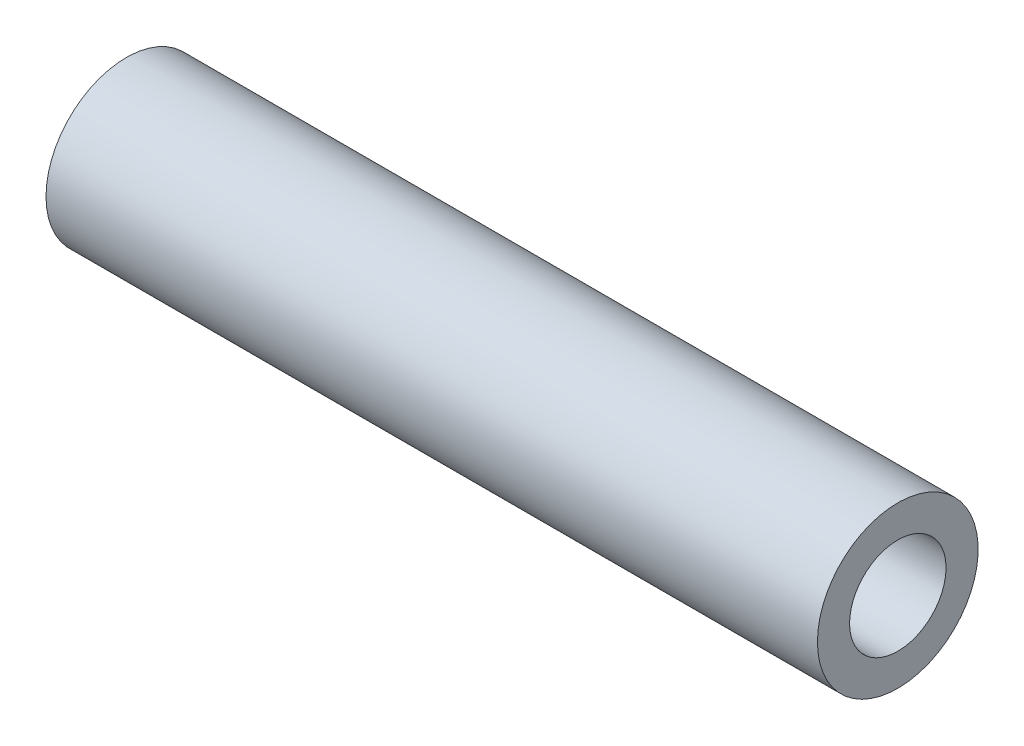
ISO-10303-21;
HEADER;
FILE_DESCRIPTION(('STEP AP214'),'2;1');
FILE_NAME('part.step','',(''),(''),'','','');
FILE_SCHEMA(('AUTOMOTIVE_DESIGN { 1 0 10303 214 1 1 1 1 }'));
ENDSEC;
DATA;
#1=APPLICATION_CONTEXT('core data for automotive mechanical design processes');
#2=APPLICATION_PROTOCOL_DEFINITION('international standard','automotive_design',2000,#1);
#3=PRODUCT_CONTEXT('',#1,'mechanical');
#4=PRODUCT('Part','Part','',(#3));
#5=PRODUCT_RELATED_PRODUCT_CATEGORY('part','',(#4));
#6=PRODUCT_DEFINITION_FORMATION('','',#4);
#7=PRODUCT_DEFINITION_CONTEXT('part definition',#1,'design');
#8=PRODUCT_DEFINITION('design','',#6,#7);
#9=PRODUCT_DEFINITION_SHAPE('','',#8);
#10=(LENGTH_UNIT() NAMED_UNIT(*) SI_UNIT(.MILLI.,.METRE.));
#11=(NAMED_UNIT(*) PLANE_ANGLE_UNIT() SI_UNIT($,.RADIAN.));
#12=(NAMED_UNIT(*) SI_UNIT($,.STERADIAN.) SOLID_ANGLE_UNIT());
#13=UNCERTAINTY_MEASURE_WITH_UNIT(LENGTH_MEASURE(1.E-05),#10,'distance_accuracy_value','');
#14=(GEOMETRIC_REPRESENTATION_CONTEXT(3) GLOBAL_UNCERTAINTY_ASSIGNED_CONTEXT((#13)) GLOBAL_UNIT_ASSIGNED_CONTEXT((#10,
#11,#12)) REPRESENTATION_CONTEXT('',''));
#15=CARTESIAN_POINT('',(0.,0.,0.));
#16=DIRECTION('',(0.,0.,1.));
#17=DIRECTION('',(1.,0.,0.));
#18=AXIS2_PLACEMENT_3D('',#15,#16,#17);
#19=CARTESIAN_POINT('',(0.,12.7,0.));
#20=DIRECTION('',(1.,0.,0.));
#21=DIRECTION('',(0.,0.,-1.));
#22=AXIS2_PLACEMENT_3D('',#19,#20,#21);
#23=PLANE('',#22);
#24=CARTESIAN_POINT('',(0.,0.,0.));
#25=DIRECTION('',(-1.,0.,0.));
#26=DIRECTION('',(0.,0.,1.));
#27=AXIS2_PLACEMENT_3D('',#24,#25,#26);
#28=CIRCLE('',#27,12.7);
#29=CARTESIAN_POINT('',(0.,0.,12.7));
#30=VERTEX_POINT('',#29);
#31=EDGE_CURVE('E49',#30,#30,#28,.T.);
#32=ORIENTED_EDGE('',*,*,#31,.F.);
#33=EDGE_LOOP('',(#32));
#34=FACE_BOUND('',#33,.T.);
#35=CARTESIAN_POINT('',(0.,0.,0.));
#36=DIRECTION('',(-1.,0.,0.));
#37=DIRECTION('',(0.,0.,1.));
#38=AXIS2_PLACEMENT_3D('',#35,#36,#37);
#39=CIRCLE('',#38,21.1666666666667);
#40=CARTESIAN_POINT('',(0.,0.,21.1666666666667));
#41=VERTEX_POINT('',#40);
#42=EDGE_CURVE('E10',#41,#41,#39,.T.);
#43=ORIENTED_EDGE('',*,*,#42,.T.);
#44=EDGE_LOOP('',(#43));
#45=FACE_BOUND('',#44,.T.);
#46=ADVANCED_FACE('F35',(#34,#45),#23,.F.);
#47=CARTESIAN_POINT('',(0.,0.,0.));
#48=DIRECTION('',(-1.,0.,0.));
#49=DIRECTION('',(0.,0.,1.));
#50=AXIS2_PLACEMENT_3D('',#47,#48,#49);
#51=CYLINDRICAL_SURFACE('',#50,21.1666666666667);
#52=ORIENTED_EDGE('',*,*,#42,.F.);
#53=EDGE_LOOP('',(#52));
#54=FACE_BOUND('',#53,.T.);
#55=CARTESIAN_POINT('',(203.2,0.,0.));
#56=DIRECTION('',(-1.,0.,0.));
#57=DIRECTION('',(0.,0.,1.));
#58=AXIS2_PLACEMENT_3D('',#55,#56,#57);
#59=CIRCLE('',#58,21.1666666666667);
#60=CARTESIAN_POINT('',(203.2,0.,21.1666666666667));
#61=VERTEX_POINT('',#60);
#62=EDGE_CURVE('E41',#61,#61,#59,.T.);
#63=ORIENTED_EDGE('',*,*,#62,.T.);
#64=EDGE_LOOP('',(#63));
#65=FACE_BOUND('',#64,.T.);
#66=ADVANCED_FACE('F58',(#54,#65),#51,.T.);
#67=CARTESIAN_POINT('',(203.2,12.7,0.));
#68=DIRECTION('',(-1.,0.,0.));
#69=DIRECTION('',(0.,0.,1.));
#70=AXIS2_PLACEMENT_3D('',#67,#68,#69);
#71=PLANE('',#70);
#72=ORIENTED_EDGE('',*,*,#62,.F.);
#73=EDGE_LOOP('',(#72));
#74=FACE_BOUND('',#73,.T.);
#75=CARTESIAN_POINT('',(203.2,0.,0.));
#76=DIRECTION('',(-1.,0.,0.));
#77=DIRECTION('',(0.,0.,1.));
#78=AXIS2_PLACEMENT_3D('',#75,#76,#77);
#79=CIRCLE('',#78,12.7);
#80=CARTESIAN_POINT('',(203.2,0.,12.7));
#81=VERTEX_POINT('',#80);
#82=EDGE_CURVE('E45',#81,#81,#79,.T.);
#83=ORIENTED_EDGE('',*,*,#82,.T.);
#84=EDGE_LOOP('',(#83));
#85=FACE_BOUND('',#84,.T.);
#86=ADVANCED_FACE('F62',(#74,#85),#71,.F.);
#87=CARTESIAN_POINT('',(0.,0.,0.));
#88=DIRECTION('',(-1.,0.,0.));
#89=DIRECTION('',(0.,0.,1.));
#90=AXIS2_PLACEMENT_3D('',#87,#88,#89);
#91=CYLINDRICAL_SURFACE('',#90,12.7);
#92=ORIENTED_EDGE('',*,*,#82,.F.);
#93=EDGE_LOOP('',(#92));
#94=FACE_BOUND('',#93,.T.);
#95=ORIENTED_EDGE('',*,*,#31,.T.);
#96=EDGE_LOOP('',(#95));
#97=FACE_BOUND('',#96,.T.);
#98=ADVANCED_FACE('F55',(#94,#97),#91,.F.);
#99=CLOSED_SHELL('',(#46,#66,#86,#98));
#100=MANIFOLD_SOLID_BREP('B2',#99);
#101=ADVANCED_BREP_SHAPE_REPRESENTATION('',(#18,#100),#14);
#102=SHAPE_DEFINITION_REPRESENTATION(#9,#101);
ENDSEC;
END-ISO-10303-21;
